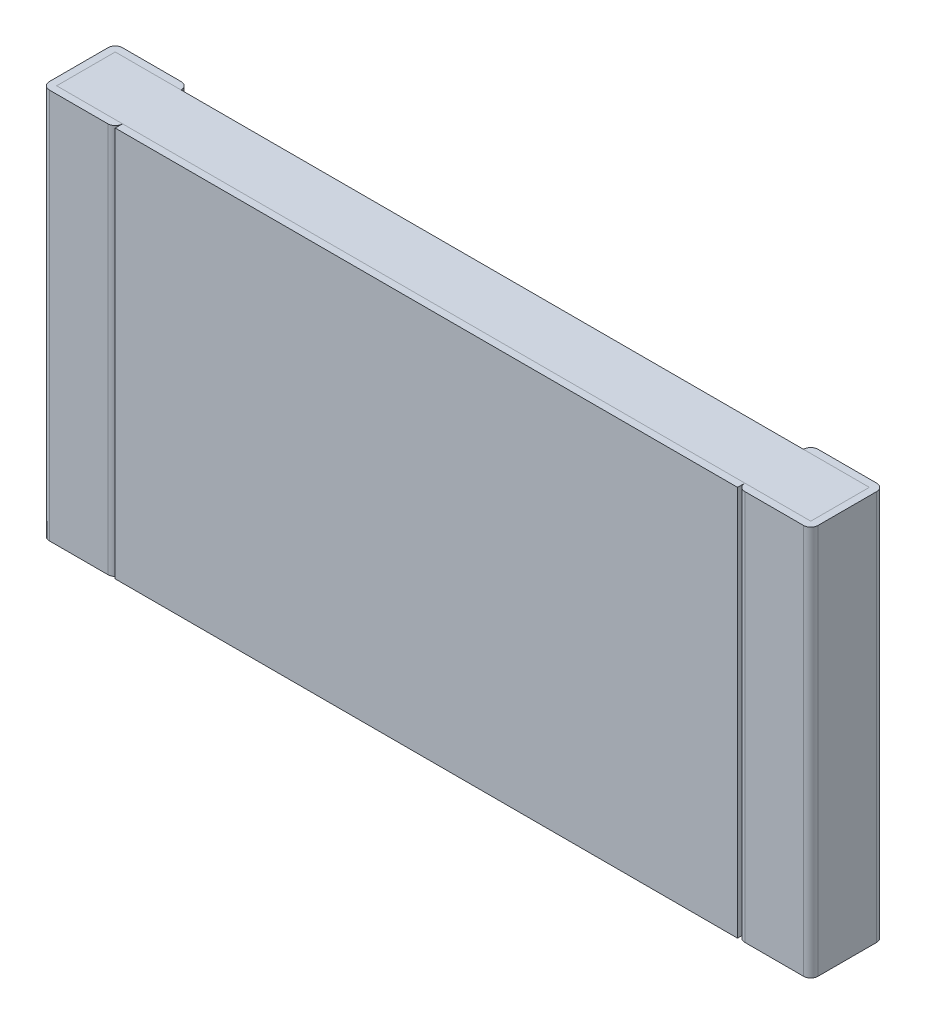
ISO-10303-21;
HEADER;
FILE_DESCRIPTION(('STEP AP214'),'2;1');
FILE_NAME('part.step','',(''),(''),'','','');
FILE_SCHEMA(('AUTOMOTIVE_DESIGN { 1 0 10303 214 1 1 1 1 }'));
ENDSEC;
DATA;
#1=APPLICATION_CONTEXT('core data for automotive mechanical design processes');
#2=APPLICATION_PROTOCOL_DEFINITION('international standard','automotive_design',2000,#1);
#3=PRODUCT_CONTEXT('',#1,'mechanical');
#4=PRODUCT('Part','Part','',(#3));
#5=PRODUCT_RELATED_PRODUCT_CATEGORY('part','',(#4));
#6=PRODUCT_DEFINITION_FORMATION('','',#4);
#7=PRODUCT_DEFINITION_CONTEXT('part definition',#1,'design');
#8=PRODUCT_DEFINITION('design','',#6,#7);
#9=PRODUCT_DEFINITION_SHAPE('','',#8);
#10=(LENGTH_UNIT() NAMED_UNIT(*) SI_UNIT(.MILLI.,.METRE.));
#11=(NAMED_UNIT(*) PLANE_ANGLE_UNIT() SI_UNIT($,.RADIAN.));
#12=(NAMED_UNIT(*) SI_UNIT($,.STERADIAN.) SOLID_ANGLE_UNIT());
#13=UNCERTAINTY_MEASURE_WITH_UNIT(LENGTH_MEASURE(1.E-05),#10,'distance_accuracy_value','');
#14=(GEOMETRIC_REPRESENTATION_CONTEXT(3) GLOBAL_UNCERTAINTY_ASSIGNED_CONTEXT((#13)) GLOBAL_UNIT_ASSIGNED_CONTEXT((#10,
#11,#12)) REPRESENTATION_CONTEXT('',''));
#15=CARTESIAN_POINT('',(0.,0.,0.));
#16=DIRECTION('',(0.,0.,1.));
#17=DIRECTION('',(1.,0.,0.));
#18=AXIS2_PLACEMENT_3D('',#15,#16,#17);
#19=CARTESIAN_POINT('',(-2.55,-1.6,0.6));
#20=DIRECTION('',(0.,0.,1.));
#21=DIRECTION('',(1.,0.,0.));
#22=AXIS2_PLACEMENT_3D('',#19,#20,#21);
#23=PLANE('',#22);
#24=DIRECTION('',(0.,1.,0.));
#25=VECTOR('',#24,1.);
#26=CARTESIAN_POINT('',(-2.55,-1.6,0.6));
#27=LINE('',#26,#25);
#28=CARTESIAN_POINT('',(-2.55,-1.6,0.6));
#29=VERTEX_POINT('',#28);
#30=CARTESIAN_POINT('',(-2.55,1.6,0.6));
#31=VERTEX_POINT('',#30);
#32=EDGE_CURVE('E299',#29,#31,#27,.T.);
#33=ORIENTED_EDGE('',*,*,#32,.F.);
#34=DIRECTION('',(1.,0.,0.));
#35=VECTOR('',#34,1.);
#36=CARTESIAN_POINT('',(-2.55,-1.6,0.6));
#37=LINE('',#36,#35);
#38=CARTESIAN_POINT('',(2.55,-1.6,0.6));
#39=VERTEX_POINT('',#38);
#40=EDGE_CURVE('E407',#29,#39,#37,.T.);
#41=ORIENTED_EDGE('',*,*,#40,.T.);
#42=DIRECTION('',(0.,1.,0.));
#43=VECTOR('',#42,1.);
#44=CARTESIAN_POINT('',(2.55,-1.6,0.6));
#45=LINE('',#44,#43);
#46=CARTESIAN_POINT('',(2.55,1.6,0.6));
#47=VERTEX_POINT('',#46);
#48=EDGE_CURVE('E11',#39,#47,#45,.T.);
#49=ORIENTED_EDGE('',*,*,#48,.T.);
#50=DIRECTION('',(1.,0.,0.));
#51=VECTOR('',#50,1.);
#52=CARTESIAN_POINT('',(-2.55,1.6,0.6));
#53=LINE('',#52,#51);
#54=EDGE_CURVE('E426',#31,#47,#53,.T.);
#55=ORIENTED_EDGE('',*,*,#54,.F.);
#56=EDGE_LOOP('',(#33,#41,#49,#55));
#57=FACE_BOUND('',#56,.T.);
#58=ADVANCED_FACE('F17',(#57),#23,.T.);
#59=CARTESIAN_POINT('',(2.55,-1.6,0.54));
#60=DIRECTION('',(1.,0.,0.));
#61=DIRECTION('',(0.,1.,0.));
#62=AXIS2_PLACEMENT_3D('',#59,#60,#61);
#63=PLANE('',#62);
#64=DIRECTION('',(0.,0.,1.));
#65=VECTOR('',#64,1.);
#66=CARTESIAN_POINT('',(2.55,-1.6,0.54));
#67=LINE('',#66,#65);
#68=CARTESIAN_POINT('',(2.55,-1.6,0.54));
#69=VERTEX_POINT('',#68);
#70=EDGE_CURVE('E403',#69,#39,#67,.T.);
#71=ORIENTED_EDGE('',*,*,#70,.F.);
#72=DIRECTION('',(0.,1.,0.));
#73=VECTOR('',#72,1.);
#74=CARTESIAN_POINT('',(2.55,-1.6,0.54));
#75=LINE('',#74,#73);
#76=CARTESIAN_POINT('',(2.55,1.6,0.54));
#77=VERTEX_POINT('',#76);
#78=EDGE_CURVE('E26',#69,#77,#75,.T.);
#79=ORIENTED_EDGE('',*,*,#78,.T.);
#80=DIRECTION('',(0.,0.,1.));
#81=VECTOR('',#80,1.);
#82=CARTESIAN_POINT('',(2.55,1.6,0.54));
#83=LINE('',#82,#81);
#84=EDGE_CURVE('E359',#77,#47,#83,.T.);
#85=ORIENTED_EDGE('',*,*,#84,.T.);
#86=ORIENTED_EDGE('',*,*,#48,.F.);
#87=EDGE_LOOP('',(#71,#79,#85,#86));
#88=FACE_BOUND('',#87,.T.);
#89=ADVANCED_FACE('F19',(#88),#63,.T.);
#90=CARTESIAN_POINT('',(2.61,-1.6,0.54));
#91=DIRECTION('',(0.,1.,0.));
#92=DIRECTION('',(-1.,0.,0.));
#93=AXIS2_PLACEMENT_3D('',#90,#91,#92);
#94=CYLINDRICAL_SURFACE('',#93,0.06);
#95=CARTESIAN_POINT('',(2.61,-1.6,0.54));
#96=DIRECTION('',(0.,1.,0.));
#97=DIRECTION('',(0.,0.,1.));
#98=AXIS2_PLACEMENT_3D('',#95,#96,#97);
#99=CIRCLE('',#98,0.06);
#100=CARTESIAN_POINT('',(2.61,-1.6,0.6));
#101=VERTEX_POINT('',#100);
#102=EDGE_CURVE('E258',#69,#101,#99,.T.);
#103=ORIENTED_EDGE('',*,*,#102,.T.);
#104=DIRECTION('',(0.,1.,0.));
#105=VECTOR('',#104,1.);
#106=CARTESIAN_POINT('',(2.61,-1.6,0.6));
#107=LINE('',#106,#105);
#108=CARTESIAN_POINT('',(2.61,1.6,0.6));
#109=VERTEX_POINT('',#108);
#110=EDGE_CURVE('E346',#101,#109,#107,.T.);
#111=ORIENTED_EDGE('',*,*,#110,.T.);
#112=CARTESIAN_POINT('',(2.61,1.6,0.54));
#113=DIRECTION('',(0.,1.,0.));
#114=DIRECTION('',(0.,0.,1.));
#115=AXIS2_PLACEMENT_3D('',#112,#113,#114);
#116=CIRCLE('',#115,0.06);
#117=EDGE_CURVE('E419',#77,#109,#116,.T.);
#118=ORIENTED_EDGE('',*,*,#117,.F.);
#119=ORIENTED_EDGE('',*,*,#78,.F.);
#120=EDGE_LOOP('',(#103,#111,#118,#119));
#121=FACE_BOUND('',#120,.T.);
#122=ADVANCED_FACE('F443',(#121),#94,.T.);
#123=CARTESIAN_POINT('',(2.55,-1.6,0.6));
#124=DIRECTION('',(0.,0.,1.));
#125=DIRECTION('',(1.,0.,0.));
#126=AXIS2_PLACEMENT_3D('',#123,#124,#125);
#127=PLANE('',#126);
#128=DIRECTION('',(1.,0.,0.));
#129=VECTOR('',#128,1.);
#130=CARTESIAN_POINT('',(2.55,1.6,0.6));
#131=LINE('',#130,#129);
#132=CARTESIAN_POINT('',(3.09,1.6,0.6));
#133=VERTEX_POINT('',#132);
#134=EDGE_CURVE('E352',#109,#133,#131,.T.);
#135=ORIENTED_EDGE('',*,*,#134,.F.);
#136=ORIENTED_EDGE('',*,*,#110,.F.);
#137=DIRECTION('',(1.,0.,0.));
#138=VECTOR('',#137,1.);
#139=CARTESIAN_POINT('',(2.55,-1.6,0.6));
#140=LINE('',#139,#138);
#141=CARTESIAN_POINT('',(3.09,-1.6,0.6));
#142=VERTEX_POINT('',#141);
#143=EDGE_CURVE('E261',#101,#142,#140,.T.);
#144=ORIENTED_EDGE('',*,*,#143,.T.);
#145=DIRECTION('',(0.,1.,0.));
#146=VECTOR('',#145,1.);
#147=CARTESIAN_POINT('',(3.09,-1.6,0.6));
#148=LINE('',#147,#146);
#149=EDGE_CURVE('E436',#142,#133,#148,.T.);
#150=ORIENTED_EDGE('',*,*,#149,.T.);
#151=EDGE_LOOP('',(#135,#136,#144,#150));
#152=FACE_BOUND('',#151,.T.);
#153=ADVANCED_FACE('F448',(#152),#127,.T.);
#154=CARTESIAN_POINT('',(3.09,-1.6,0.54));
#155=DIRECTION('',(0.,1.,0.));
#156=DIRECTION('',(1.,0.,0.));
#157=AXIS2_PLACEMENT_3D('',#154,#155,#156);
#158=CYLINDRICAL_SURFACE('',#157,0.06);
#159=DIRECTION('',(0.,1.,0.));
#160=VECTOR('',#159,1.);
#161=CARTESIAN_POINT('',(3.15,-1.6,0.54));
#162=LINE('',#161,#160);
#163=CARTESIAN_POINT('',(3.15,-1.6,0.54));
#164=VERTEX_POINT('',#163);
#165=CARTESIAN_POINT('',(3.15,1.6,0.54));
#166=VERTEX_POINT('',#165);
#167=EDGE_CURVE('E327',#164,#166,#162,.T.);
#168=ORIENTED_EDGE('',*,*,#167,.T.);
#169=CARTESIAN_POINT('',(3.09,1.6,0.54));
#170=DIRECTION('',(0.,-1.,0.));
#171=DIRECTION('',(0.,0.,1.));
#172=AXIS2_PLACEMENT_3D('',#169,#170,#171);
#173=CIRCLE('',#172,0.06);
#174=EDGE_CURVE('E347',#166,#133,#173,.T.);
#175=ORIENTED_EDGE('',*,*,#174,.T.);
#176=ORIENTED_EDGE('',*,*,#149,.F.);
#177=CARTESIAN_POINT('',(3.09,-1.6,0.54));
#178=DIRECTION('',(0.,-1.,0.));
#179=DIRECTION('',(0.,0.,1.));
#180=AXIS2_PLACEMENT_3D('',#177,#178,#179);
#181=CIRCLE('',#180,0.06);
#182=EDGE_CURVE('E311',#164,#142,#181,.T.);
#183=ORIENTED_EDGE('',*,*,#182,.F.);
#184=EDGE_LOOP('',(#168,#175,#176,#183));
#185=FACE_BOUND('',#184,.T.);
#186=ADVANCED_FACE('F511',(#185),#158,.T.);
#187=CARTESIAN_POINT('',(3.15,-1.6,0.));
#188=DIRECTION('',(1.,0.,0.));
#189=DIRECTION('',(0.,1.,0.));
#190=AXIS2_PLACEMENT_3D('',#187,#188,#189);
#191=PLANE('',#190);
#192=DIRECTION('',(0.,0.,1.));
#193=VECTOR('',#192,1.);
#194=CARTESIAN_POINT('',(3.15,-1.6,0.));
#195=LINE('',#194,#193);
#196=CARTESIAN_POINT('',(3.15,-1.6,0.06));
#197=VERTEX_POINT('',#196);
#198=EDGE_CURVE('E381',#197,#164,#195,.T.);
#199=ORIENTED_EDGE('',*,*,#198,.F.);
#200=DIRECTION('',(0.,1.,0.));
#201=VECTOR('',#200,1.);
#202=CARTESIAN_POINT('',(3.15,-1.6,0.06));
#203=LINE('',#202,#201);
#204=CARTESIAN_POINT('',(3.15,1.6,0.06));
#205=VERTEX_POINT('',#204);
#206=EDGE_CURVE('E46',#197,#205,#203,.T.);
#207=ORIENTED_EDGE('',*,*,#206,.T.);
#208=DIRECTION('',(0.,0.,1.));
#209=VECTOR('',#208,1.);
#210=CARTESIAN_POINT('',(3.15,1.6,0.));
#211=LINE('',#210,#209);
#212=EDGE_CURVE('E351',#205,#166,#211,.T.);
#213=ORIENTED_EDGE('',*,*,#212,.T.);
#214=ORIENTED_EDGE('',*,*,#167,.F.);
#215=EDGE_LOOP('',(#199,#207,#213,#214));
#216=FACE_BOUND('',#215,.T.);
#217=ADVANCED_FACE('F507',(#216),#191,.T.);
#218=CARTESIAN_POINT('',(3.09,-1.6,0.06));
#219=DIRECTION('',(0.,1.,0.));
#220=DIRECTION('',(1.,0.,0.));
#221=AXIS2_PLACEMENT_3D('',#218,#219,#220);
#222=CYLINDRICAL_SURFACE('',#221,0.06);
#223=CARTESIAN_POINT('',(3.09,-1.6,0.06));
#224=DIRECTION('',(0.,1.,0.));
#225=DIRECTION('',(0.,0.,1.));
#226=AXIS2_PLACEMENT_3D('',#223,#224,#225);
#227=CIRCLE('',#226,0.06);
#228=CARTESIAN_POINT('',(3.09,-1.6,0.));
#229=VERTEX_POINT('',#228);
#230=EDGE_CURVE('E377',#197,#229,#227,.T.);
#231=ORIENTED_EDGE('',*,*,#230,.T.);
#232=DIRECTION('',(0.,1.,0.));
#233=VECTOR('',#232,1.);
#234=CARTESIAN_POINT('',(3.09,-1.6,0.));
#235=LINE('',#234,#233);
#236=CARTESIAN_POINT('',(3.09,1.6,0.));
#237=VERTEX_POINT('',#236);
#238=EDGE_CURVE('E328',#229,#237,#235,.T.);
#239=ORIENTED_EDGE('',*,*,#238,.T.);
#240=CARTESIAN_POINT('',(3.09,1.6,0.06));
#241=DIRECTION('',(0.,1.,0.));
#242=DIRECTION('',(0.,0.,1.));
#243=AXIS2_PLACEMENT_3D('',#240,#241,#242);
#244=CIRCLE('',#243,0.06);
#245=EDGE_CURVE('E384',#205,#237,#244,.T.);
#246=ORIENTED_EDGE('',*,*,#245,.F.);
#247=ORIENTED_EDGE('',*,*,#206,.F.);
#248=EDGE_LOOP('',(#231,#239,#246,#247));
#249=FACE_BOUND('',#248,.T.);
#250=ADVANCED_FACE('F503',(#249),#222,.T.);
#251=CARTESIAN_POINT('',(2.55,-1.6,0.));
#252=DIRECTION('',(0.,0.,1.));
#253=DIRECTION('',(1.,0.,0.));
#254=AXIS2_PLACEMENT_3D('',#251,#252,#253);
#255=PLANE('',#254);
#256=ORIENTED_EDGE('',*,*,#238,.F.);
#257=DIRECTION('',(1.,0.,0.));
#258=VECTOR('',#257,1.);
#259=CARTESIAN_POINT('',(2.55,-1.6,0.));
#260=LINE('',#259,#258);
#261=CARTESIAN_POINT('',(2.61,-1.6,0.));
#262=VERTEX_POINT('',#261);
#263=EDGE_CURVE('E394',#262,#229,#260,.T.);
#264=ORIENTED_EDGE('',*,*,#263,.F.);
#265=DIRECTION('',(0.,1.,0.));
#266=VECTOR('',#265,1.);
#267=CARTESIAN_POINT('',(2.61,-1.6,0.));
#268=LINE('',#267,#266);
#269=CARTESIAN_POINT('',(2.61,1.6,0.));
#270=VERTEX_POINT('',#269);
#271=EDGE_CURVE('E356',#262,#270,#268,.T.);
#272=ORIENTED_EDGE('',*,*,#271,.T.);
#273=DIRECTION('',(1.,0.,0.));
#274=VECTOR('',#273,1.);
#275=CARTESIAN_POINT('',(2.55,1.6,0.));
#276=LINE('',#275,#274);
#277=EDGE_CURVE('E395',#270,#237,#276,.T.);
#278=ORIENTED_EDGE('',*,*,#277,.T.);
#279=EDGE_LOOP('',(#256,#264,#272,#278));
#280=FACE_BOUND('',#279,.T.);
#281=ADVANCED_FACE('F499',(#280),#255,.F.);
#282=CARTESIAN_POINT('',(2.61,-1.6,0.06));
#283=DIRECTION('',(0.,1.,0.));
#284=DIRECTION('',(-1.,0.,0.));
#285=AXIS2_PLACEMENT_3D('',#282,#283,#284);
#286=CYLINDRICAL_SURFACE('',#285,0.06);
#287=DIRECTION('',(0.,1.,0.));
#288=VECTOR('',#287,1.);
#289=CARTESIAN_POINT('',(2.55,-1.6,0.06));
#290=LINE('',#289,#288);
#291=CARTESIAN_POINT('',(2.55,-1.6,0.06));
#292=VERTEX_POINT('',#291);
#293=CARTESIAN_POINT('',(2.55,1.6,0.06));
#294=VERTEX_POINT('',#293);
#295=EDGE_CURVE('E373',#292,#294,#290,.T.);
#296=ORIENTED_EDGE('',*,*,#295,.T.);
#297=CARTESIAN_POINT('',(2.61,1.6,0.06));
#298=DIRECTION('',(0.,-1.,0.));
#299=DIRECTION('',(0.,0.,1.));
#300=AXIS2_PLACEMENT_3D('',#297,#298,#299);
#301=CIRCLE('',#300,0.06);
#302=EDGE_CURVE('E399',#294,#270,#301,.T.);
#303=ORIENTED_EDGE('',*,*,#302,.T.);
#304=ORIENTED_EDGE('',*,*,#271,.F.);
#305=CARTESIAN_POINT('',(2.61,-1.6,0.06));
#306=DIRECTION('',(0.,-1.,0.));
#307=DIRECTION('',(0.,0.,1.));
#308=AXIS2_PLACEMENT_3D('',#305,#306,#307);
#309=CIRCLE('',#308,0.06);
#310=EDGE_CURVE('E260',#292,#262,#309,.T.);
#311=ORIENTED_EDGE('',*,*,#310,.F.);
#312=EDGE_LOOP('',(#296,#303,#304,#311));
#313=FACE_BOUND('',#312,.T.);
#314=ADVANCED_FACE('F496',(#313),#286,.T.);
#315=CARTESIAN_POINT('',(-2.55,1.6,0.54));
#316=DIRECTION('',(0.,1.,0.));
#317=DIRECTION('',(1.,0.,0.));
#318=AXIS2_PLACEMENT_3D('',#315,#316,#317);
#319=PLANE('',#318);
#320=DIRECTION('',(1.,0.,0.));
#321=VECTOR('',#320,1.);
#322=CARTESIAN_POINT('',(-2.55,1.6,0.54));
#323=LINE('',#322,#321);
#324=CARTESIAN_POINT('',(-2.55,1.6,0.54));
#325=VERTEX_POINT('',#324);
#326=EDGE_CURVE('E263',#325,#77,#323,.T.);
#327=ORIENTED_EDGE('',*,*,#326,.F.);
#328=DIRECTION('',(0.,0.,1.));
#329=VECTOR('',#328,1.);
#330=CARTESIAN_POINT('',(-2.55,1.6,0.54));
#331=LINE('',#330,#329);
#332=EDGE_CURVE('E303',#325,#31,#331,.T.);
#333=ORIENTED_EDGE('',*,*,#332,.T.);
#334=ORIENTED_EDGE('',*,*,#54,.T.);
#335=ORIENTED_EDGE('',*,*,#84,.F.);
#336=EDGE_LOOP('',(#327,#333,#334,#335));
#337=FACE_BOUND('',#336,.T.);
#338=ADVANCED_FACE('F461',(#337),#319,.T.);
#339=CARTESIAN_POINT('',(2.55,1.6,0.));
#340=DIRECTION('',(0.,1.,0.));
#341=DIRECTION('',(1.,0.,0.));
#342=AXIS2_PLACEMENT_3D('',#339,#340,#341);
#343=PLANE('',#342);
#344=ORIENTED_EDGE('',*,*,#277,.F.);
#345=ORIENTED_EDGE('',*,*,#302,.F.);
#346=DIRECTION('',(1.,0.,0.));
#347=VECTOR('',#346,1.);
#348=CARTESIAN_POINT('',(-3.09,1.6,0.06));
#349=LINE('',#348,#347);
#350=CARTESIAN_POINT('',(3.09,1.6,0.06));
#351=VERTEX_POINT('',#350);
#352=EDGE_CURVE('E366',#294,#351,#349,.T.);
#353=ORIENTED_EDGE('',*,*,#352,.T.);
#354=DIRECTION('',(0.,0.,1.));
#355=VECTOR('',#354,1.);
#356=CARTESIAN_POINT('',(3.09,1.6,0.06));
#357=LINE('',#356,#355);
#358=CARTESIAN_POINT('',(3.09,1.6,0.54));
#359=VERTEX_POINT('',#358);
#360=EDGE_CURVE('E363',#351,#359,#357,.T.);
#361=ORIENTED_EDGE('',*,*,#360,.T.);
#362=DIRECTION('',(1.,0.,0.));
#363=VECTOR('',#362,1.);
#364=CARTESIAN_POINT('',(-3.09,1.6,0.54));
#365=LINE('',#364,#363);
#366=EDGE_CURVE('E267',#77,#359,#365,.T.);
#367=ORIENTED_EDGE('',*,*,#366,.F.);
#368=ORIENTED_EDGE('',*,*,#117,.T.);
#369=ORIENTED_EDGE('',*,*,#134,.T.);
#370=ORIENTED_EDGE('',*,*,#174,.F.);
#371=ORIENTED_EDGE('',*,*,#212,.F.);
#372=ORIENTED_EDGE('',*,*,#245,.T.);
#373=EDGE_LOOP('',(#344,#345,#353,#361,#367,#368,#369,#370,#371,#372));
#374=FACE_BOUND('',#373,.T.);
#375=ADVANCED_FACE('F452',(#374),#343,.T.);
#376=CARTESIAN_POINT('',(-2.55,-1.6,0.54));
#377=DIRECTION('',(1.,0.,0.));
#378=DIRECTION('',(0.,1.,0.));
#379=AXIS2_PLACEMENT_3D('',#376,#377,#378);
#380=PLANE('',#379);
#381=ORIENTED_EDGE('',*,*,#32,.T.);
#382=ORIENTED_EDGE('',*,*,#332,.F.);
#383=DIRECTION('',(0.,1.,0.));
#384=VECTOR('',#383,1.);
#385=CARTESIAN_POINT('',(-2.55,-1.6,0.54));
#386=LINE('',#385,#384);
#387=CARTESIAN_POINT('',(-2.55,-1.6,0.54));
#388=VERTEX_POINT('',#387);
#389=EDGE_CURVE('E268',#388,#325,#386,.T.);
#390=ORIENTED_EDGE('',*,*,#389,.F.);
#391=DIRECTION('',(0.,0.,1.));
#392=VECTOR('',#391,1.);
#393=CARTESIAN_POINT('',(-2.55,-1.6,0.54));
#394=LINE('',#393,#392);
#395=EDGE_CURVE('E304',#388,#29,#394,.T.);
#396=ORIENTED_EDGE('',*,*,#395,.T.);
#397=EDGE_LOOP('',(#381,#382,#390,#396));
#398=FACE_BOUND('',#397,.T.);
#399=ADVANCED_FACE('F467',(#398),#380,.F.);
#400=CARTESIAN_POINT('',(-2.55,-1.6,0.54));
#401=DIRECTION('',(0.,1.,0.));
#402=DIRECTION('',(1.,0.,0.));
#403=AXIS2_PLACEMENT_3D('',#400,#401,#402);
#404=PLANE('',#403);
#405=ORIENTED_EDGE('',*,*,#70,.T.);
#406=ORIENTED_EDGE('',*,*,#40,.F.);
#407=ORIENTED_EDGE('',*,*,#395,.F.);
#408=DIRECTION('',(1.,0.,0.));
#409=VECTOR('',#408,1.);
#410=CARTESIAN_POINT('',(-2.55,-1.6,0.54));
#411=LINE('',#410,#409);
#412=EDGE_CURVE('E337',#388,#69,#411,.T.);
#413=ORIENTED_EDGE('',*,*,#412,.T.);
#414=EDGE_LOOP('',(#405,#406,#407,#413));
#415=FACE_BOUND('',#414,.T.);
#416=ADVANCED_FACE('F474',(#415),#404,.F.);
#417=CARTESIAN_POINT('',(2.55,-1.6,0.));
#418=DIRECTION('',(0.,1.,0.));
#419=DIRECTION('',(1.,0.,0.));
#420=AXIS2_PLACEMENT_3D('',#417,#418,#419);
#421=PLANE('',#420);
#422=ORIENTED_EDGE('',*,*,#230,.F.);
#423=ORIENTED_EDGE('',*,*,#198,.T.);
#424=ORIENTED_EDGE('',*,*,#182,.T.);
#425=ORIENTED_EDGE('',*,*,#143,.F.);
#426=ORIENTED_EDGE('',*,*,#102,.F.);
#427=DIRECTION('',(1.,0.,0.));
#428=VECTOR('',#427,1.);
#429=CARTESIAN_POINT('',(-3.09,-1.6,0.54));
#430=LINE('',#429,#428);
#431=CARTESIAN_POINT('',(3.09,-1.6,0.54));
#432=VERTEX_POINT('',#431);
#433=EDGE_CURVE('E336',#69,#432,#430,.T.);
#434=ORIENTED_EDGE('',*,*,#433,.T.);
#435=DIRECTION('',(0.,0.,1.));
#436=VECTOR('',#435,1.);
#437=CARTESIAN_POINT('',(3.09,-1.6,0.06));
#438=LINE('',#437,#436);
#439=CARTESIAN_POINT('',(3.09,-1.6,0.06));
#440=VERTEX_POINT('',#439);
#441=EDGE_CURVE('E332',#440,#432,#438,.T.);
#442=ORIENTED_EDGE('',*,*,#441,.F.);
#443=DIRECTION('',(1.,0.,0.));
#444=VECTOR('',#443,1.);
#445=CARTESIAN_POINT('',(-3.09,-1.6,0.06));
#446=LINE('',#445,#444);
#447=EDGE_CURVE('E278',#292,#440,#446,.T.);
#448=ORIENTED_EDGE('',*,*,#447,.F.);
#449=ORIENTED_EDGE('',*,*,#310,.T.);
#450=ORIENTED_EDGE('',*,*,#263,.T.);
#451=EDGE_LOOP('',(#422,#423,#424,#425,#426,#434,#442,#448,#449,#450));
#452=FACE_BOUND('',#451,.T.);
#453=ADVANCED_FACE('F495',(#452),#421,.F.);
#454=CARTESIAN_POINT('',(-3.09,-1.6,0.06));
#455=DIRECTION('',(0.,0.,1.));
#456=DIRECTION('',(1.,0.,0.));
#457=AXIS2_PLACEMENT_3D('',#454,#455,#456);
#458=PLANE('',#457);
#459=DIRECTION('',(1.,0.,0.));
#460=VECTOR('',#459,1.);
#461=CARTESIAN_POINT('',(-3.09,1.6,0.06));
#462=LINE('',#461,#460);
#463=CARTESIAN_POINT('',(-2.55,1.6,0.06));
#464=VERTEX_POINT('',#463);
#465=EDGE_CURVE('E369',#464,#294,#462,.T.);
#466=ORIENTED_EDGE('',*,*,#465,.T.);
#467=ORIENTED_EDGE('',*,*,#295,.F.);
#468=DIRECTION('',(1.,0.,0.));
#469=VECTOR('',#468,1.);
#470=CARTESIAN_POINT('',(-3.09,-1.6,0.06));
#471=LINE('',#470,#469);
#472=CARTESIAN_POINT('',(-2.55,-1.6,0.06));
#473=VERTEX_POINT('',#472);
#474=EDGE_CURVE('E274',#473,#292,#471,.T.);
#475=ORIENTED_EDGE('',*,*,#474,.F.);
#476=DIRECTION('',(0.,1.,0.));
#477=VECTOR('',#476,1.);
#478=CARTESIAN_POINT('',(-2.55,-1.6,0.06));
#479=LINE('',#478,#477);
#480=EDGE_CURVE('E279',#473,#464,#479,.T.);
#481=ORIENTED_EDGE('',*,*,#480,.T.);
#482=EDGE_LOOP('',(#466,#467,#475,#481));
#483=FACE_BOUND('',#482,.T.);
#484=ADVANCED_FACE('F492',(#483),#458,.F.);
#485=CARTESIAN_POINT('',(-3.09,1.6,0.06));
#486=DIRECTION('',(0.,1.,0.));
#487=DIRECTION('',(1.,0.,0.));
#488=AXIS2_PLACEMENT_3D('',#485,#486,#487);
#489=PLANE('',#488);
#490=DIRECTION('',(1.,0.,0.));
#491=VECTOR('',#490,1.);
#492=CARTESIAN_POINT('',(-3.09,1.6,0.06));
#493=LINE('',#492,#491);
#494=CARTESIAN_POINT('',(-3.09,1.6,0.06));
#495=VERTEX_POINT('',#494);
#496=EDGE_CURVE('E307',#495,#464,#493,.T.);
#497=ORIENTED_EDGE('',*,*,#496,.F.);
#498=DIRECTION('',(0.,0.,1.));
#499=VECTOR('',#498,1.);
#500=CARTESIAN_POINT('',(-3.09,1.6,0.06));
#501=LINE('',#500,#499);
#502=CARTESIAN_POINT('',(-3.09,1.6,0.54));
#503=VERTEX_POINT('',#502);
#504=EDGE_CURVE('E298',#495,#503,#501,.T.);
#505=ORIENTED_EDGE('',*,*,#504,.T.);
#506=DIRECTION('',(1.,0.,0.));
#507=VECTOR('',#506,1.);
#508=CARTESIAN_POINT('',(-3.09,1.6,0.54));
#509=LINE('',#508,#507);
#510=EDGE_CURVE('E294',#503,#325,#509,.T.);
#511=ORIENTED_EDGE('',*,*,#510,.T.);
#512=ORIENTED_EDGE('',*,*,#326,.T.);
#513=ORIENTED_EDGE('',*,*,#366,.T.);
#514=ORIENTED_EDGE('',*,*,#360,.F.);
#515=ORIENTED_EDGE('',*,*,#352,.F.);
#516=ORIENTED_EDGE('',*,*,#465,.F.);
#517=EDGE_LOOP('',(#497,#505,#511,#512,#513,#514,#515,#516));
#518=FACE_BOUND('',#517,.T.);
#519=ADVANCED_FACE('F456',(#518),#489,.T.);
#520=CARTESIAN_POINT('',(-2.61,-1.6,0.54));
#521=DIRECTION('',(0.,1.,0.));
#522=DIRECTION('',(1.,0.,0.));
#523=AXIS2_PLACEMENT_3D('',#520,#521,#522);
#524=CYLINDRICAL_SURFACE('',#523,0.06);
#525=ORIENTED_EDGE('',*,*,#389,.T.);
#526=CARTESIAN_POINT('',(-2.61,1.6,0.54));
#527=DIRECTION('',(0.,-1.,0.));
#528=DIRECTION('',(0.,0.,1.));
#529=AXIS2_PLACEMENT_3D('',#526,#527,#528);
#530=CIRCLE('',#529,0.06);
#531=CARTESIAN_POINT('',(-2.61,1.6,0.6));
#532=VERTEX_POINT('',#531);
#533=EDGE_CURVE('E290',#325,#532,#530,.T.);
#534=ORIENTED_EDGE('',*,*,#533,.T.);
#535=DIRECTION('',(0.,1.,0.));
#536=VECTOR('',#535,1.);
#537=CARTESIAN_POINT('',(-2.61,-1.6,0.6));
#538=LINE('',#537,#536);
#539=CARTESIAN_POINT('',(-2.61,-1.6,0.6));
#540=VERTEX_POINT('',#539);
#541=EDGE_CURVE('E341',#540,#532,#538,.T.);
#542=ORIENTED_EDGE('',*,*,#541,.F.);
#543=CARTESIAN_POINT('',(-2.61,-1.6,0.54));
#544=DIRECTION('',(0.,-1.,0.));
#545=DIRECTION('',(0.,0.,1.));
#546=AXIS2_PLACEMENT_3D('',#543,#544,#545);
#547=CIRCLE('',#546,0.06);
#548=EDGE_CURVE('E245',#388,#540,#547,.T.);
#549=ORIENTED_EDGE('',*,*,#548,.F.);
#550=EDGE_LOOP('',(#525,#534,#542,#549));
#551=FACE_BOUND('',#550,.T.);
#552=ADVANCED_FACE('F464',(#551),#524,.T.);
#553=CARTESIAN_POINT('',(-3.15,-1.6,0.6));
#554=DIRECTION('',(0.,0.,1.));
#555=DIRECTION('',(1.,0.,0.));
#556=AXIS2_PLACEMENT_3D('',#553,#554,#555);
#557=PLANE('',#556);
#558=DIRECTION('',(1.,0.,0.));
#559=VECTOR('',#558,1.);
#560=CARTESIAN_POINT('',(-3.15,1.6,0.6));
#561=LINE('',#560,#559);
#562=CARTESIAN_POINT('',(-3.09,1.6,0.6));
#563=VERTEX_POINT('',#562);
#564=EDGE_CURVE('E223',#563,#532,#561,.T.);
#565=ORIENTED_EDGE('',*,*,#564,.F.);
#566=DIRECTION('',(0.,1.,0.));
#567=VECTOR('',#566,1.);
#568=CARTESIAN_POINT('',(-3.09,-1.6,0.6));
#569=LINE('',#568,#567);
#570=CARTESIAN_POINT('',(-3.09,-1.6,0.6));
#571=VERTEX_POINT('',#570);
#572=EDGE_CURVE('E216',#571,#563,#569,.T.);
#573=ORIENTED_EDGE('',*,*,#572,.F.);
#574=DIRECTION('',(1.,0.,0.));
#575=VECTOR('',#574,1.);
#576=CARTESIAN_POINT('',(-3.15,-1.6,0.6));
#577=LINE('',#576,#575);
#578=EDGE_CURVE('E220',#571,#540,#577,.T.);
#579=ORIENTED_EDGE('',*,*,#578,.T.);
#580=ORIENTED_EDGE('',*,*,#541,.T.);
#581=EDGE_LOOP('',(#565,#573,#579,#580));
#582=FACE_BOUND('',#581,.T.);
#583=ADVANCED_FACE('F218',(#582),#557,.T.);
#584=CARTESIAN_POINT('',(-3.09,-1.6,0.06));
#585=DIRECTION('',(0.,1.,0.));
#586=DIRECTION('',(1.,0.,0.));
#587=AXIS2_PLACEMENT_3D('',#584,#585,#586);
#588=PLANE('',#587);
#589=ORIENTED_EDGE('',*,*,#474,.T.);
#590=ORIENTED_EDGE('',*,*,#447,.T.);
#591=ORIENTED_EDGE('',*,*,#441,.T.);
#592=ORIENTED_EDGE('',*,*,#433,.F.);
#593=ORIENTED_EDGE('',*,*,#412,.F.);
#594=DIRECTION('',(1.,0.,0.));
#595=VECTOR('',#594,1.);
#596=CARTESIAN_POINT('',(-3.09,-1.6,0.54));
#597=LINE('',#596,#595);
#598=CARTESIAN_POINT('',(-3.09,-1.6,0.54));
#599=VERTEX_POINT('',#598);
#600=EDGE_CURVE('E252',#599,#388,#597,.T.);
#601=ORIENTED_EDGE('',*,*,#600,.F.);
#602=DIRECTION('',(0.,0.,1.));
#603=VECTOR('',#602,1.);
#604=CARTESIAN_POINT('',(-3.09,-1.6,0.06));
#605=LINE('',#604,#603);
#606=CARTESIAN_POINT('',(-3.09,-1.6,0.06));
#607=VERTEX_POINT('',#606);
#608=EDGE_CURVE('E849',#607,#599,#605,.T.);
#609=ORIENTED_EDGE('',*,*,#608,.F.);
#610=DIRECTION('',(1.,0.,0.));
#611=VECTOR('',#610,1.);
#612=CARTESIAN_POINT('',(-3.09,-1.6,0.06));
#613=LINE('',#612,#611);
#614=EDGE_CURVE('E845',#607,#473,#613,.T.);
#615=ORIENTED_EDGE('',*,*,#614,.T.);
#616=EDGE_LOOP('',(#589,#590,#591,#592,#593,#601,#609,#615));
#617=FACE_BOUND('',#616,.T.);
#618=ADVANCED_FACE('F471',(#617),#588,.F.);
#619=CARTESIAN_POINT('',(-2.61,-1.6,0.06));
#620=DIRECTION('',(0.,1.,0.));
#621=DIRECTION('',(1.,0.,0.));
#622=AXIS2_PLACEMENT_3D('',#619,#620,#621);
#623=CYLINDRICAL_SURFACE('',#622,0.06);
#624=CARTESIAN_POINT('',(-2.61,-1.6,0.06));
#625=DIRECTION('',(0.,1.,0.));
#626=DIRECTION('',(0.,0.,1.));
#627=AXIS2_PLACEMENT_3D('',#624,#625,#626);
#628=CIRCLE('',#627,0.06);
#629=CARTESIAN_POINT('',(-2.61,-1.6,0.));
#630=VERTEX_POINT('',#629);
#631=EDGE_CURVE('E843',#473,#630,#628,.T.);
#632=ORIENTED_EDGE('',*,*,#631,.T.);
#633=DIRECTION('',(0.,1.,0.));
#634=VECTOR('',#633,1.);
#635=CARTESIAN_POINT('',(-2.61,-1.6,0.));
#636=LINE('',#635,#634);
#637=CARTESIAN_POINT('',(-2.61,1.6,0.));
#638=VERTEX_POINT('',#637);
#639=EDGE_CURVE('E319',#630,#638,#636,.T.);
#640=ORIENTED_EDGE('',*,*,#639,.T.);
#641=CARTESIAN_POINT('',(-2.61,1.6,0.06));
#642=DIRECTION('',(0.,1.,0.));
#643=DIRECTION('',(0.,0.,1.));
#644=AXIS2_PLACEMENT_3D('',#641,#642,#643);
#645=CIRCLE('',#644,0.06);
#646=EDGE_CURVE('E315',#464,#638,#645,.T.);
#647=ORIENTED_EDGE('',*,*,#646,.F.);
#648=ORIENTED_EDGE('',*,*,#480,.F.);
#649=EDGE_LOOP('',(#632,#640,#647,#648));
#650=FACE_BOUND('',#649,.T.);
#651=ADVANCED_FACE('F616',(#650),#623,.T.);
#652=CARTESIAN_POINT('',(-3.15,-1.6,0.));
#653=DIRECTION('',(0.,0.,1.));
#654=DIRECTION('',(1.,0.,0.));
#655=AXIS2_PLACEMENT_3D('',#652,#653,#654);
#656=PLANE('',#655);
#657=ORIENTED_EDGE('',*,*,#639,.F.);
#658=DIRECTION('',(1.,0.,0.));
#659=VECTOR('',#658,1.);
#660=CARTESIAN_POINT('',(-3.15,-1.6,0.));
#661=LINE('',#660,#659);
#662=CARTESIAN_POINT('',(-3.09,-1.6,0.));
#663=VERTEX_POINT('',#662);
#664=EDGE_CURVE('E269',#663,#630,#661,.T.);
#665=ORIENTED_EDGE('',*,*,#664,.F.);
#666=DIRECTION('',(0.,1.,0.));
#667=VECTOR('',#666,1.);
#668=CARTESIAN_POINT('',(-3.09,-1.6,0.));
#669=LINE('',#668,#667);
#670=CARTESIAN_POINT('',(-3.09,1.6,0.));
#671=VERTEX_POINT('',#670);
#672=EDGE_CURVE('E228',#663,#671,#669,.T.);
#673=ORIENTED_EDGE('',*,*,#672,.T.);
#674=DIRECTION('',(1.,0.,0.));
#675=VECTOR('',#674,1.);
#676=CARTESIAN_POINT('',(-3.15,1.6,0.));
#677=LINE('',#676,#675);
#678=EDGE_CURVE('E256',#671,#638,#677,.T.);
#679=ORIENTED_EDGE('',*,*,#678,.T.);
#680=EDGE_LOOP('',(#657,#665,#673,#679));
#681=FACE_BOUND('',#680,.T.);
#682=ADVANCED_FACE('F621',(#681),#656,.F.);
#683=CARTESIAN_POINT('',(-3.15,1.6,0.));
#684=DIRECTION('',(0.,1.,0.));
#685=DIRECTION('',(1.,0.,0.));
#686=AXIS2_PLACEMENT_3D('',#683,#684,#685);
#687=PLANE('',#686);
#688=ORIENTED_EDGE('',*,*,#678,.F.);
#689=CARTESIAN_POINT('',(-3.09,1.6,0.06));
#690=DIRECTION('',(0.,-1.,0.));
#691=DIRECTION('',(0.,0.,1.));
#692=AXIS2_PLACEMENT_3D('',#689,#690,#691);
#693=CIRCLE('',#692,0.06);
#694=CARTESIAN_POINT('',(-3.15,1.6,0.06));
#695=VERTEX_POINT('',#694);
#696=EDGE_CURVE('E273',#695,#671,#693,.T.);
#697=ORIENTED_EDGE('',*,*,#696,.F.);
#698=DIRECTION('',(0.,0.,1.));
#699=VECTOR('',#698,1.);
#700=CARTESIAN_POINT('',(-3.15,1.6,0.));
#701=LINE('',#700,#699);
#702=CARTESIAN_POINT('',(-3.15,1.6,0.54));
#703=VERTEX_POINT('',#702);
#704=EDGE_CURVE('E828',#695,#703,#701,.T.);
#705=ORIENTED_EDGE('',*,*,#704,.T.);
#706=CARTESIAN_POINT('',(-3.09,1.6,0.54));
#707=DIRECTION('',(0.,1.,0.));
#708=DIRECTION('',(0.,0.,1.));
#709=AXIS2_PLACEMENT_3D('',#706,#707,#708);
#710=CIRCLE('',#709,0.06);
#711=EDGE_CURVE('E227',#703,#563,#710,.T.);
#712=ORIENTED_EDGE('',*,*,#711,.T.);
#713=ORIENTED_EDGE('',*,*,#564,.T.);
#714=ORIENTED_EDGE('',*,*,#533,.F.);
#715=ORIENTED_EDGE('',*,*,#510,.F.);
#716=ORIENTED_EDGE('',*,*,#504,.F.);
#717=ORIENTED_EDGE('',*,*,#496,.T.);
#718=ORIENTED_EDGE('',*,*,#646,.T.);
#719=EDGE_LOOP('',(#688,#697,#705,#712,#713,#714,#715,#716,#717,#718));
#720=FACE_BOUND('',#719,.T.);
#721=ADVANCED_FACE('F630',(#720),#687,.T.);
#722=CARTESIAN_POINT('',(-3.09,-1.6,0.54));
#723=DIRECTION('',(0.,1.,0.));
#724=DIRECTION('',(-1.,0.,0.));
#725=AXIS2_PLACEMENT_3D('',#722,#723,#724);
#726=CYLINDRICAL_SURFACE('',#725,0.06);
#727=CARTESIAN_POINT('',(-3.09,-1.6,0.54));
#728=DIRECTION('',(0.,1.,0.));
#729=DIRECTION('',(0.,0.,1.));
#730=AXIS2_PLACEMENT_3D('',#727,#728,#729);
#731=CIRCLE('',#730,0.06);
#732=CARTESIAN_POINT('',(-3.15,-1.6,0.54));
#733=VERTEX_POINT('',#732);
#734=EDGE_CURVE('E231',#733,#571,#731,.T.);
#735=ORIENTED_EDGE('',*,*,#734,.T.);
#736=ORIENTED_EDGE('',*,*,#572,.T.);
#737=ORIENTED_EDGE('',*,*,#711,.F.);
#738=DIRECTION('',(0.,1.,0.));
#739=VECTOR('',#738,1.);
#740=CARTESIAN_POINT('',(-3.15,-1.6,0.54));
#741=LINE('',#740,#739);
#742=EDGE_CURVE('E234',#733,#703,#741,.T.);
#743=ORIENTED_EDGE('',*,*,#742,.F.);
#744=EDGE_LOOP('',(#735,#736,#737,#743));
#745=FACE_BOUND('',#744,.T.);
#746=ADVANCED_FACE('F232',(#745),#726,.T.);
#747=CARTESIAN_POINT('',(-3.09,-1.6,0.06));
#748=DIRECTION('',(0.,1.,0.));
#749=DIRECTION('',(-1.,0.,0.));
#750=AXIS2_PLACEMENT_3D('',#747,#748,#749);
#751=CYLINDRICAL_SURFACE('',#750,0.06);
#752=DIRECTION('',(0.,1.,0.));
#753=VECTOR('',#752,1.);
#754=CARTESIAN_POINT('',(-3.15,-1.6,0.06));
#755=LINE('',#754,#753);
#756=CARTESIAN_POINT('',(-3.15,-1.6,0.06));
#757=VERTEX_POINT('',#756);
#758=EDGE_CURVE('E835',#757,#695,#755,.T.);
#759=ORIENTED_EDGE('',*,*,#758,.T.);
#760=ORIENTED_EDGE('',*,*,#696,.T.);
#761=ORIENTED_EDGE('',*,*,#672,.F.);
#762=CARTESIAN_POINT('',(-3.09,-1.6,0.06));
#763=DIRECTION('',(0.,-1.,0.));
#764=DIRECTION('',(0.,0.,1.));
#765=AXIS2_PLACEMENT_3D('',#762,#763,#764);
#766=CIRCLE('',#765,0.06);
#767=EDGE_CURVE('E239',#757,#663,#766,.T.);
#768=ORIENTED_EDGE('',*,*,#767,.F.);
#769=EDGE_LOOP('',(#759,#760,#761,#768));
#770=FACE_BOUND('',#769,.T.);
#771=ADVANCED_FACE('F646',(#770),#751,.T.);
#772=CARTESIAN_POINT('',(-3.15,-1.6,0.));
#773=DIRECTION('',(0.,1.,0.));
#774=DIRECTION('',(1.,0.,0.));
#775=AXIS2_PLACEMENT_3D('',#772,#773,#774);
#776=PLANE('',#775);
#777=ORIENTED_EDGE('',*,*,#631,.F.);
#778=ORIENTED_EDGE('',*,*,#614,.F.);
#779=ORIENTED_EDGE('',*,*,#608,.T.);
#780=ORIENTED_EDGE('',*,*,#600,.T.);
#781=ORIENTED_EDGE('',*,*,#548,.T.);
#782=ORIENTED_EDGE('',*,*,#578,.F.);
#783=ORIENTED_EDGE('',*,*,#734,.F.);
#784=DIRECTION('',(0.,0.,1.));
#785=VECTOR('',#784,1.);
#786=CARTESIAN_POINT('',(-3.15,-1.6,0.));
#787=LINE('',#786,#785);
#788=EDGE_CURVE('E829',#757,#733,#787,.T.);
#789=ORIENTED_EDGE('',*,*,#788,.F.);
#790=ORIENTED_EDGE('',*,*,#767,.T.);
#791=ORIENTED_EDGE('',*,*,#664,.T.);
#792=EDGE_LOOP('',(#777,#778,#779,#780,#781,#782,#783,#789,#790,#791));
#793=FACE_BOUND('',#792,.T.);
#794=ADVANCED_FACE('F242',(#793),#776,.F.);
#795=CARTESIAN_POINT('',(-3.15,-1.6,0.));
#796=DIRECTION('',(1.,0.,0.));
#797=DIRECTION('',(0.,1.,0.));
#798=AXIS2_PLACEMENT_3D('',#795,#796,#797);
#799=PLANE('',#798);
#800=ORIENTED_EDGE('',*,*,#742,.T.);
#801=ORIENTED_EDGE('',*,*,#704,.F.);
#802=ORIENTED_EDGE('',*,*,#758,.F.);
#803=ORIENTED_EDGE('',*,*,#788,.T.);
#804=EDGE_LOOP('',(#800,#801,#802,#803));
#805=FACE_BOUND('',#804,.T.);
#806=ADVANCED_FACE('F662',(#805),#799,.F.);
#807=CLOSED_SHELL('',(#58,#89,#122,#153,#186,#217,#250,#281,#314,#338,#375,#399,#416,#453,#484,
#519,#552,#583,#618,#651,#682,#721,#746,#771,#794,#806));
#808=MANIFOLD_SOLID_BREP('B1',#807);
#809=ADVANCED_BREP_SHAPE_REPRESENTATION('',(#18,#808),#14);
#810=SHAPE_DEFINITION_REPRESENTATION(#9,#809);
ENDSEC;
END-ISO-10303-21;
